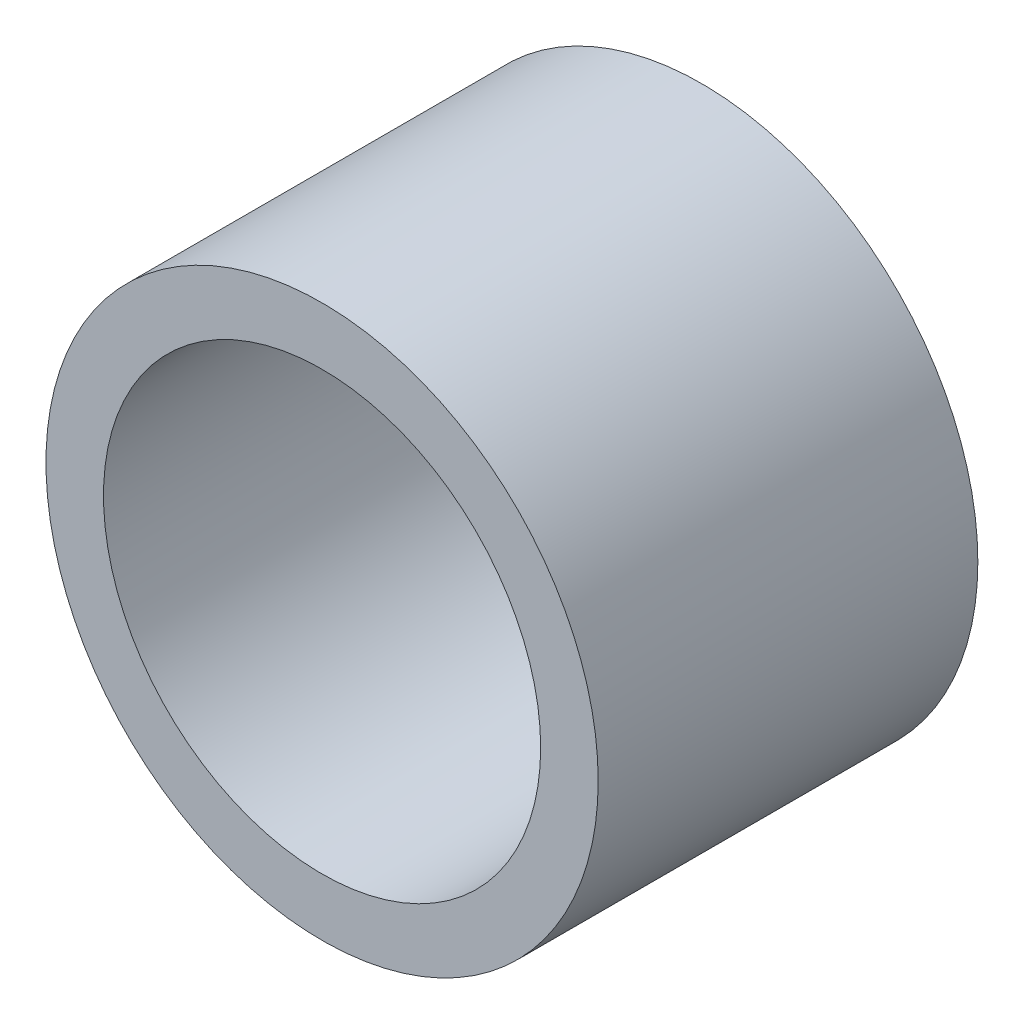
ISO-10303-21;
HEADER;
FILE_DESCRIPTION(('STEP AP214'),'2;1');
FILE_NAME('part.step','',(''),(''),'','','');
FILE_SCHEMA(('AUTOMOTIVE_DESIGN { 1 0 10303 214 1 1 1 1 }'));
ENDSEC;
DATA;
#1=APPLICATION_CONTEXT('core data for automotive mechanical design processes');
#2=APPLICATION_PROTOCOL_DEFINITION('international standard','automotive_design',2000,#1);
#3=PRODUCT_CONTEXT('',#1,'mechanical');
#4=PRODUCT('Part','Part','',(#3));
#5=PRODUCT_RELATED_PRODUCT_CATEGORY('part','',(#4));
#6=PRODUCT_DEFINITION_FORMATION('','',#4);
#7=PRODUCT_DEFINITION_CONTEXT('part definition',#1,'design');
#8=PRODUCT_DEFINITION('design','',#6,#7);
#9=PRODUCT_DEFINITION_SHAPE('','',#8);
#10=(LENGTH_UNIT() NAMED_UNIT(*) SI_UNIT(.MILLI.,.METRE.));
#11=(NAMED_UNIT(*) PLANE_ANGLE_UNIT() SI_UNIT($,.RADIAN.));
#12=(NAMED_UNIT(*) SI_UNIT($,.STERADIAN.) SOLID_ANGLE_UNIT());
#13=UNCERTAINTY_MEASURE_WITH_UNIT(LENGTH_MEASURE(1.E-05),#10,'distance_accuracy_value','');
#14=(GEOMETRIC_REPRESENTATION_CONTEXT(3) GLOBAL_UNCERTAINTY_ASSIGNED_CONTEXT((#13)) GLOBAL_UNIT_ASSIGNED_CONTEXT((#10,
#11,#12)) REPRESENTATION_CONTEXT('',''));
#15=CARTESIAN_POINT('',(0.,0.,0.));
#16=DIRECTION('',(0.,0.,1.));
#17=DIRECTION('',(1.,0.,0.));
#18=AXIS2_PLACEMENT_3D('',#15,#16,#17);
#19=CARTESIAN_POINT('',(0.,0.,13.509375));
#20=DIRECTION('',(0.,0.,1.));
#21=DIRECTION('',(1.,0.,0.));
#22=AXIS2_PLACEMENT_3D('',#19,#20,#21);
#23=PLANE('',#22);
#24=CARTESIAN_POINT('',(0.,0.,13.509375));
#25=DIRECTION('',(0.,0.,1.));
#26=DIRECTION('',(1.,0.,0.));
#27=AXIS2_PLACEMENT_3D('',#24,#25,#26);
#28=CIRCLE('',#27,7.65);
#29=CARTESIAN_POINT('',(7.65,0.,13.509375));
#30=VERTEX_POINT('',#29);
#31=EDGE_CURVE('E10',#30,#30,#28,.T.);
#32=ORIENTED_EDGE('',*,*,#31,.T.);
#33=EDGE_LOOP('',(#32));
#34=FACE_BOUND('',#33,.T.);
#35=CARTESIAN_POINT('',(0.,0.,13.509375));
#36=DIRECTION('',(0.,0.,1.));
#37=DIRECTION('',(1.,0.,0.));
#38=AXIS2_PLACEMENT_3D('',#35,#36,#37);
#39=CIRCLE('',#38,6.05625);
#40=CARTESIAN_POINT('',(6.05625,0.,13.509375));
#41=VERTEX_POINT('',#40);
#42=EDGE_CURVE('E56',#41,#41,#39,.T.);
#43=ORIENTED_EDGE('',*,*,#42,.F.);
#44=EDGE_LOOP('',(#43));
#45=FACE_BOUND('',#44,.T.);
#46=ADVANCED_FACE('F43',(#34,#45),#23,.T.);
#47=CARTESIAN_POINT('',(0.,0.,2.990625));
#48=DIRECTION('',(0.,0.,1.));
#49=DIRECTION('',(1.,0.,0.));
#50=AXIS2_PLACEMENT_3D('',#47,#48,#49);
#51=PLANE('',#50);
#52=CARTESIAN_POINT('',(0.,0.,2.990625));
#53=DIRECTION('',(0.,0.,1.));
#54=DIRECTION('',(1.,0.,0.));
#55=AXIS2_PLACEMENT_3D('',#52,#53,#54);
#56=CIRCLE('',#55,7.65);
#57=CARTESIAN_POINT('',(7.65,0.,2.990625));
#58=VERTEX_POINT('',#57);
#59=EDGE_CURVE('E47',#58,#58,#56,.T.);
#60=ORIENTED_EDGE('',*,*,#59,.F.);
#61=EDGE_LOOP('',(#60));
#62=FACE_BOUND('',#61,.T.);
#63=CARTESIAN_POINT('',(0.,0.,2.990625));
#64=DIRECTION('',(0.,0.,1.));
#65=DIRECTION('',(1.,0.,0.));
#66=AXIS2_PLACEMENT_3D('',#63,#64,#65);
#67=CIRCLE('',#66,6.05625);
#68=CARTESIAN_POINT('',(6.05625,0.,2.990625));
#69=VERTEX_POINT('',#68);
#70=EDGE_CURVE('E58',#69,#69,#67,.T.);
#71=ORIENTED_EDGE('',*,*,#70,.T.);
#72=EDGE_LOOP('',(#71));
#73=FACE_BOUND('',#72,.T.);
#74=ADVANCED_FACE('F70',(#62,#73),#51,.F.);
#75=CARTESIAN_POINT('',(0.,0.,13.509375));
#76=DIRECTION('',(0.,0.,-1.));
#77=DIRECTION('',(-1.,0.,0.));
#78=AXIS2_PLACEMENT_3D('',#75,#76,#77);
#79=CYLINDRICAL_SURFACE('',#78,7.65);
#80=ORIENTED_EDGE('',*,*,#31,.F.);
#81=EDGE_LOOP('',(#80));
#82=FACE_BOUND('',#81,.T.);
#83=ORIENTED_EDGE('',*,*,#59,.T.);
#84=EDGE_LOOP('',(#83));
#85=FACE_BOUND('',#84,.T.);
#86=ADVANCED_FACE('F45',(#82,#85),#79,.T.);
#87=CARTESIAN_POINT('',(0.,0.,13.509375));
#88=DIRECTION('',(0.,0.,-1.));
#89=DIRECTION('',(-1.,0.,0.));
#90=AXIS2_PLACEMENT_3D('',#87,#88,#89);
#91=CYLINDRICAL_SURFACE('',#90,6.05625);
#92=ORIENTED_EDGE('',*,*,#42,.T.);
#93=EDGE_LOOP('',(#92));
#94=FACE_BOUND('',#93,.T.);
#95=ORIENTED_EDGE('',*,*,#70,.F.);
#96=EDGE_LOOP('',(#95));
#97=FACE_BOUND('',#96,.T.);
#98=ADVANCED_FACE('F66',(#94,#97),#91,.F.);
#99=CLOSED_SHELL('',(#46,#74,#86,#98));
#100=MANIFOLD_SOLID_BREP('B2',#99);
#101=ADVANCED_BREP_SHAPE_REPRESENTATION('',(#18,#100),#14);
#102=SHAPE_DEFINITION_REPRESENTATION(#9,#101);
ENDSEC;
END-ISO-10303-21;
